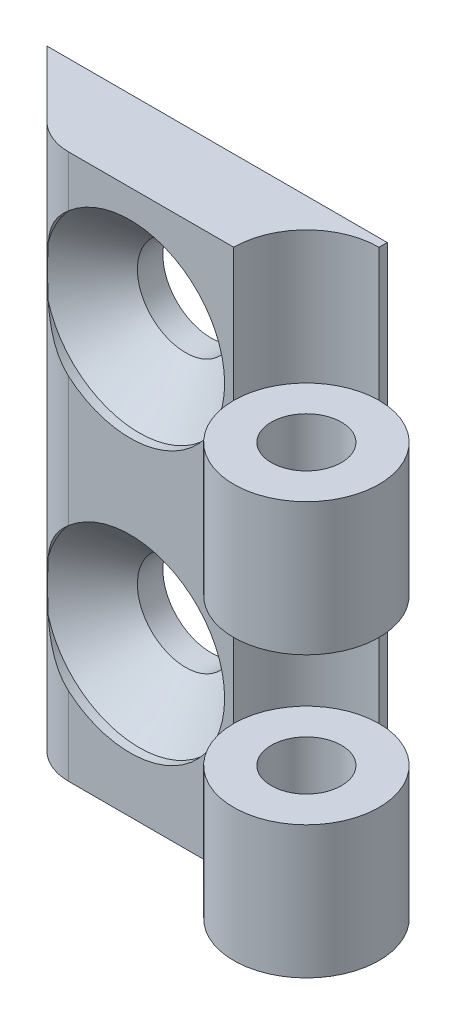
ISO-10303-21;
HEADER;
FILE_DESCRIPTION(('STEP AP214'),'2;1');
FILE_NAME('part.step','',(''),(''),'','','');
FILE_SCHEMA(('AUTOMOTIVE_DESIGN { 1 0 10303 214 1 1 1 1 }'));
ENDSEC;
DATA;
#1=APPLICATION_CONTEXT('core data for automotive mechanical design processes');
#2=APPLICATION_PROTOCOL_DEFINITION('international standard','automotive_design',2000,#1);
#3=PRODUCT_CONTEXT('',#1,'mechanical');
#4=PRODUCT('Part','Part','',(#3));
#5=PRODUCT_RELATED_PRODUCT_CATEGORY('part','',(#4));
#6=PRODUCT_DEFINITION_FORMATION('','',#4);
#7=PRODUCT_DEFINITION_CONTEXT('part definition',#1,'design');
#8=PRODUCT_DEFINITION('design','',#6,#7);
#9=PRODUCT_DEFINITION_SHAPE('','',#8);
#10=(LENGTH_UNIT() NAMED_UNIT(*) SI_UNIT(.MILLI.,.METRE.));
#11=(NAMED_UNIT(*) PLANE_ANGLE_UNIT() SI_UNIT($,.RADIAN.));
#12=(NAMED_UNIT(*) SI_UNIT($,.STERADIAN.) SOLID_ANGLE_UNIT());
#13=UNCERTAINTY_MEASURE_WITH_UNIT(LENGTH_MEASURE(1.E-05),#10,'distance_accuracy_value','');
#14=(GEOMETRIC_REPRESENTATION_CONTEXT(3) GLOBAL_UNCERTAINTY_ASSIGNED_CONTEXT((#13)) GLOBAL_UNIT_ASSIGNED_CONTEXT((#10,
#11,#12)) REPRESENTATION_CONTEXT('',''));
#15=CARTESIAN_POINT('',(0.,0.,0.));
#16=DIRECTION('',(0.,0.,1.));
#17=DIRECTION('',(1.,0.,0.));
#18=AXIS2_PLACEMENT_3D('',#15,#16,#17);
#19=CARTESIAN_POINT('',(0.,7.3,0.));
#20=DIRECTION('',(0.,0.,-1.));
#21=DIRECTION('',(-1.,0.,0.));
#22=AXIS2_PLACEMENT_3D('',#19,#20,#21);
#23=PLANE('',#22);
#24=CARTESIAN_POINT('',(-9.7,23.25,0.));
#25=DIRECTION('',(0.,0.,1.));
#26=DIRECTION('',(1.,0.,0.));
#27=AXIS2_PLACEMENT_3D('',#24,#25,#26);
#28=CIRCLE('',#27,5.2);
#29=CARTESIAN_POINT('',(-13.08199302498,19.3000476991504,0.));
#30=VERTEX_POINT('',#29);
#31=CARTESIAN_POINT('',(-13.08199302498,27.1999523008496,0.));
#32=VERTEX_POINT('',#31);
#33=EDGE_CURVE('E144',#30,#32,#28,.T.);
#34=ORIENTED_EDGE('',*,*,#33,.F.);
#35=DIRECTION('',(0.,-1.,0.));
#36=VECTOR('',#35,1.);
#37=CARTESIAN_POINT('',(-13.08199302498,7.3,0.));
#38=LINE('',#37,#36);
#39=CARTESIAN_POINT('',(-13.08199302498,12.1999523008496,0.));
#40=VERTEX_POINT('',#39);
#41=EDGE_CURVE('E62',#30,#40,#38,.T.);
#42=ORIENTED_EDGE('',*,*,#41,.T.);
#43=CARTESIAN_POINT('',(-9.7,8.25000000000001,0.));
#44=DIRECTION('',(0.,0.,1.));
#45=DIRECTION('',(1.,0.,0.));
#46=AXIS2_PLACEMENT_3D('',#43,#44,#45);
#47=CIRCLE('',#46,5.2);
#48=CARTESIAN_POINT('',(-13.08199302498,4.30004769915042,0.));
#49=VERTEX_POINT('',#48);
#50=EDGE_CURVE('E325',#49,#40,#47,.T.);
#51=ORIENTED_EDGE('',*,*,#50,.F.);
#52=CARTESIAN_POINT('',(-13.08199302498,0.,0.));
#53=VERTEX_POINT('',#52);
#54=EDGE_CURVE('E151',#49,#53,#38,.T.);
#55=ORIENTED_EDGE('',*,*,#54,.T.);
#56=DIRECTION('',(1.,0.,0.));
#57=VECTOR('',#56,1.);
#58=CARTESIAN_POINT('',(0.,0.,0.));
#59=LINE('',#58,#57);
#60=CARTESIAN_POINT('',(-4.,0.,0.));
#61=VERTEX_POINT('',#60);
#62=EDGE_CURVE('E263',#53,#61,#59,.T.);
#63=ORIENTED_EDGE('',*,*,#62,.T.);
#64=DIRECTION('',(0.,-1.,0.));
#65=VECTOR('',#64,1.);
#66=CARTESIAN_POINT('',(-4.,7.3,0.));
#67=LINE('',#66,#65);
#68=CARTESIAN_POINT('',(-4.,7.3,0.));
#69=VERTEX_POINT('',#68);
#70=EDGE_CURVE('E167',#69,#61,#67,.T.);
#71=ORIENTED_EDGE('',*,*,#70,.F.);
#72=DIRECTION('',(0.,-1.,0.));
#73=VECTOR('',#72,1.);
#74=CARTESIAN_POINT('',(-4.,30.,0.));
#75=LINE('',#74,#73);
#76=CARTESIAN_POINT('',(-4.,15.4,0.));
#77=VERTEX_POINT('',#76);
#78=EDGE_CURVE('E285',#77,#69,#75,.T.);
#79=ORIENTED_EDGE('',*,*,#78,.F.);
#80=CARTESIAN_POINT('',(-4.,22.7,0.));
#81=VERTEX_POINT('',#80);
#82=EDGE_CURVE('E284',#81,#77,#75,.T.);
#83=ORIENTED_EDGE('',*,*,#82,.F.);
#84=CARTESIAN_POINT('',(-4.,30.,0.));
#85=VERTEX_POINT('',#84);
#86=EDGE_CURVE('E281',#85,#81,#75,.T.);
#87=ORIENTED_EDGE('',*,*,#86,.F.);
#88=DIRECTION('',(1.,0.,0.));
#89=VECTOR('',#88,1.);
#90=CARTESIAN_POINT('',(0.,30.,0.));
#91=LINE('',#90,#89);
#92=CARTESIAN_POINT('',(-13.08199302498,30.,0.));
#93=VERTEX_POINT('',#92);
#94=EDGE_CURVE('E286',#93,#85,#91,.T.);
#95=ORIENTED_EDGE('',*,*,#94,.F.);
#96=EDGE_CURVE('E150',#93,#32,#38,.T.);
#97=ORIENTED_EDGE('',*,*,#96,.T.);
#98=EDGE_LOOP('',(#34,#42,#51,#55,#63,#71,#79,#83,#87,#95,#97));
#99=FACE_BOUND('',#98,.T.);
#100=ADVANCED_FACE('F35',(#99),#23,.F.);
#101=CARTESIAN_POINT('',(0.,30.,0.));
#102=DIRECTION('',(0.,-1.,0.));
#103=DIRECTION('',(0.,0.,-1.));
#104=AXIS2_PLACEMENT_3D('',#101,#102,#103);
#105=CYLINDRICAL_SURFACE('',#104,4.);
#106=DIRECTION('',(0.,-1.,0.));
#107=VECTOR('',#106,1.);
#108=CARTESIAN_POINT('',(0.,30.,-4.));
#109=LINE('',#108,#107);
#110=CARTESIAN_POINT('',(0.,15.4,-4.));
#111=VERTEX_POINT('',#110);
#112=CARTESIAN_POINT('',(0.,7.3,-4.));
#113=VERTEX_POINT('',#112);
#114=EDGE_CURVE('E280',#111,#113,#109,.T.);
#115=ORIENTED_EDGE('',*,*,#114,.F.);
#116=CARTESIAN_POINT('',(0.,15.4,0.));
#117=DIRECTION('',(0.,1.,0.));
#118=DIRECTION('',(0.,0.,1.));
#119=AXIS2_PLACEMENT_3D('',#116,#117,#118);
#120=CIRCLE('',#119,4.);
#121=EDGE_CURVE('E303',#111,#77,#120,.T.);
#122=ORIENTED_EDGE('',*,*,#121,.T.);
#123=ORIENTED_EDGE('',*,*,#78,.T.);
#124=CARTESIAN_POINT('',(0.,7.3,0.));
#125=DIRECTION('',(0.,1.,0.));
#126=DIRECTION('',(0.,0.,1.));
#127=AXIS2_PLACEMENT_3D('',#124,#125,#126);
#128=CIRCLE('',#127,4.);
#129=EDGE_CURVE('E269',#69,#113,#128,.F.);
#130=ORIENTED_EDGE('',*,*,#129,.T.);
#131=EDGE_LOOP('',(#115,#122,#123,#130));
#132=FACE_BOUND('',#131,.T.);
#133=ADVANCED_FACE('F217',(#132),#105,.F.);
#134=CARTESIAN_POINT('',(0.,7.3,0.));
#135=DIRECTION('',(0.,-1.,0.));
#136=DIRECTION('',(0.,0.,-1.));
#137=AXIS2_PLACEMENT_3D('',#134,#135,#136);
#138=CYLINDRICAL_SURFACE('',#137,4.);
#139=CARTESIAN_POINT('',(0.,0.,0.));
#140=DIRECTION('',(0.,1.,0.));
#141=DIRECTION('',(0.,0.,1.));
#142=AXIS2_PLACEMENT_3D('',#139,#140,#141);
#143=CIRCLE('',#142,4.);
#144=CARTESIAN_POINT('',(0.,0.,-4.));
#145=VERTEX_POINT('',#144);
#146=EDGE_CURVE('E260',#61,#145,#143,.T.);
#147=ORIENTED_EDGE('',*,*,#146,.T.);
#148=DIRECTION('',(0.,-1.,0.));
#149=VECTOR('',#148,1.);
#150=CARTESIAN_POINT('',(0.,7.3,-4.));
#151=LINE('',#150,#149);
#152=EDGE_CURVE('E165',#113,#145,#151,.T.);
#153=ORIENTED_EDGE('',*,*,#152,.F.);
#154=CARTESIAN_POINT('',(0.,7.3,0.));
#155=DIRECTION('',(0.,1.,0.));
#156=DIRECTION('',(0.,0.,1.));
#157=AXIS2_PLACEMENT_3D('',#154,#155,#156);
#158=CIRCLE('',#157,4.);
#159=EDGE_CURVE('E155',#69,#113,#158,.T.);
#160=ORIENTED_EDGE('',*,*,#159,.F.);
#161=ORIENTED_EDGE('',*,*,#70,.T.);
#162=EDGE_LOOP('',(#147,#153,#160,#161));
#163=FACE_BOUND('',#162,.T.);
#164=ADVANCED_FACE('F221',(#163),#138,.T.);
#165=CARTESIAN_POINT('',(0.,7.3,0.));
#166=DIRECTION('',(1.,0.,0.));
#167=DIRECTION('',(0.,0.,-1.));
#168=AXIS2_PLACEMENT_3D('',#165,#166,#167);
#169=PLANE('',#168);
#170=DIRECTION('',(0.,0.,1.));
#171=VECTOR('',#170,1.);
#172=CARTESIAN_POINT('',(0.,0.,0.));
#173=LINE('',#172,#171);
#174=CARTESIAN_POINT('',(0.,0.,-4.45));
#175=VERTEX_POINT('',#174);
#176=EDGE_CURVE('E255',#175,#145,#173,.T.);
#177=ORIENTED_EDGE('',*,*,#176,.F.);
#178=DIRECTION('',(0.,-1.,0.));
#179=VECTOR('',#178,1.);
#180=CARTESIAN_POINT('',(0.,7.3,-4.45));
#181=LINE('',#180,#179);
#182=CARTESIAN_POINT('',(0.,30.,-4.45));
#183=VERTEX_POINT('',#182);
#184=EDGE_CURVE('E163',#183,#175,#181,.T.);
#185=ORIENTED_EDGE('',*,*,#184,.F.);
#186=DIRECTION('',(0.,0.,1.));
#187=VECTOR('',#186,1.);
#188=CARTESIAN_POINT('',(0.,30.,0.));
#189=LINE('',#188,#187);
#190=CARTESIAN_POINT('',(0.,30.,-4.));
#191=VERTEX_POINT('',#190);
#192=EDGE_CURVE('E296',#183,#191,#189,.T.);
#193=ORIENTED_EDGE('',*,*,#192,.T.);
#194=CARTESIAN_POINT('',(0.,22.7,-4.));
#195=VERTEX_POINT('',#194);
#196=EDGE_CURVE('E276',#191,#195,#109,.T.);
#197=ORIENTED_EDGE('',*,*,#196,.T.);
#198=EDGE_CURVE('E279',#195,#111,#109,.T.);
#199=ORIENTED_EDGE('',*,*,#198,.T.);
#200=ORIENTED_EDGE('',*,*,#114,.T.);
#201=ORIENTED_EDGE('',*,*,#152,.T.);
#202=EDGE_LOOP('',(#177,#185,#193,#197,#199,#200,#201));
#203=FACE_BOUND('',#202,.T.);
#204=ADVANCED_FACE('F228',(#203),#169,.T.);
#205=CARTESIAN_POINT('',(0.,7.3,-4.45));
#206=DIRECTION('',(0.,0.,1.));
#207=DIRECTION('',(1.,0.,0.));
#208=AXIS2_PLACEMENT_3D('',#205,#206,#207);
#209=PLANE('',#208);
#210=CARTESIAN_POINT('',(-9.7,23.25,-4.45));
#211=DIRECTION('',(0.,0.,1.));
#212=DIRECTION('',(1.,0.,0.));
#213=AXIS2_PLACEMENT_3D('',#210,#211,#212);
#214=CIRCLE('',#213,2.65);
#215=CARTESIAN_POINT('',(-7.05,23.25,-4.45));
#216=VERTEX_POINT('',#215);
#217=EDGE_CURVE('E327',#216,#216,#214,.T.);
#218=ORIENTED_EDGE('',*,*,#217,.T.);
#219=EDGE_LOOP('',(#218));
#220=FACE_BOUND('',#219,.T.);
#221=CARTESIAN_POINT('',(-9.7,8.25000000000001,-4.45));
#222=DIRECTION('',(0.,0.,1.));
#223=DIRECTION('',(1.,0.,0.));
#224=AXIS2_PLACEMENT_3D('',#221,#222,#223);
#225=CIRCLE('',#224,2.65);
#226=CARTESIAN_POINT('',(-7.05,8.25000000000001,-4.45));
#227=VERTEX_POINT('',#226);
#228=EDGE_CURVE('E311',#227,#227,#225,.T.);
#229=ORIENTED_EDGE('',*,*,#228,.T.);
#230=EDGE_LOOP('',(#229));
#231=FACE_BOUND('',#230,.T.);
#232=DIRECTION('',(-1.,0.,0.));
#233=VECTOR('',#232,1.);
#234=CARTESIAN_POINT('',(0.,0.,-4.45));
#235=LINE('',#234,#233);
#236=CARTESIAN_POINT('',(-18.73,0.,-4.45));
#237=VERTEX_POINT('',#236);
#238=EDGE_CURVE('E252',#175,#237,#235,.T.);
#239=ORIENTED_EDGE('',*,*,#238,.T.);
#240=DIRECTION('',(0.,-1.,0.));
#241=VECTOR('',#240,1.);
#242=CARTESIAN_POINT('',(-18.73,7.3,-4.45));
#243=LINE('',#242,#241);
#244=CARTESIAN_POINT('',(-18.73,30.,-4.45));
#245=VERTEX_POINT('',#244);
#246=EDGE_CURVE('E161',#245,#237,#243,.T.);
#247=ORIENTED_EDGE('',*,*,#246,.F.);
#248=DIRECTION('',(-1.,0.,0.));
#249=VECTOR('',#248,1.);
#250=CARTESIAN_POINT('',(0.,30.,-4.45));
#251=LINE('',#250,#249);
#252=EDGE_CURVE('E293',#183,#245,#251,.T.);
#253=ORIENTED_EDGE('',*,*,#252,.F.);
#254=ORIENTED_EDGE('',*,*,#184,.T.);
#255=EDGE_LOOP('',(#239,#247,#253,#254));
#256=FACE_BOUND('',#255,.T.);
#257=ADVANCED_FACE('F232',(#220,#231,#256),#209,.F.);
#258=CARTESIAN_POINT('',(-7.13999999999992,7.3,7.13999999999998));
#259=DIRECTION('',(-0.707106781186545,0.,0.70710678118655));
#260=DIRECTION('',(0.70710678118655,0.,0.707106781186545));
#261=AXIS2_PLACEMENT_3D('',#258,#259,#260);
#262=PLANE('',#261);
#263=DIRECTION('',(-0.70710678118655,0.,-0.707106781186545));
#264=VECTOR('',#263,1.);
#265=CARTESIAN_POINT('',(-7.13999999999992,0.,7.13999999999998));
#266=LINE('',#265,#264);
#267=CARTESIAN_POINT('',(-15.1271188559454,0.,-0.847118855945423));
#268=VERTEX_POINT('',#267);
#269=EDGE_CURVE('E245',#268,#237,#266,.T.);
#270=ORIENTED_EDGE('',*,*,#269,.F.);
#271=DIRECTION('',(0.,-1.,0.));
#272=VECTOR('',#271,1.);
#273=CARTESIAN_POINT('',(-15.1271188559454,7.3,-0.847118855945423));
#274=LINE('',#273,#272);
#275=CARTESIAN_POINT('',(-15.1271188559454,30.,-0.847118855945423));
#276=VERTEX_POINT('',#275);
#277=EDGE_CURVE('E154',#276,#268,#274,.T.);
#278=ORIENTED_EDGE('',*,*,#277,.F.);
#279=DIRECTION('',(-0.70710678118655,0.,-0.707106781186545));
#280=VECTOR('',#279,1.);
#281=CARTESIAN_POINT('',(-7.13999999999992,30.,7.13999999999998));
#282=LINE('',#281,#280);
#283=EDGE_CURVE('E291',#276,#245,#282,.T.);
#284=ORIENTED_EDGE('',*,*,#283,.T.);
#285=ORIENTED_EDGE('',*,*,#246,.T.);
#286=EDGE_LOOP('',(#270,#278,#284,#285));
#287=FACE_BOUND('',#286,.T.);
#288=ADVANCED_FACE('F235',(#287),#262,.T.);
#289=CARTESIAN_POINT('',(0.,7.3,0.));
#290=DIRECTION('',(0.,-1.,0.));
#291=DIRECTION('',(0.,0.,-1.));
#292=AXIS2_PLACEMENT_3D('',#289,#290,#291);
#293=CYLINDRICAL_SURFACE('',#292,1.93);
#294=CARTESIAN_POINT('',(0.,7.3,0.));
#295=DIRECTION('',(0.,1.,0.));
#296=DIRECTION('',(0.,0.,1.));
#297=AXIS2_PLACEMENT_3D('',#294,#295,#296);
#298=CIRCLE('',#297,1.93);
#299=CARTESIAN_POINT('',(0.,7.3,1.93));
#300=VERTEX_POINT('',#299);
#301=EDGE_CURVE('E254',#300,#300,#298,.T.);
#302=ORIENTED_EDGE('',*,*,#301,.T.);
#303=EDGE_LOOP('',(#302));
#304=FACE_BOUND('',#303,.T.);
#305=CARTESIAN_POINT('',(0.,0.,0.));
#306=DIRECTION('',(0.,1.,0.));
#307=DIRECTION('',(0.,0.,1.));
#308=AXIS2_PLACEMENT_3D('',#305,#306,#307);
#309=CIRCLE('',#308,1.93);
#310=CARTESIAN_POINT('',(0.,0.,1.93));
#311=VERTEX_POINT('',#310);
#312=EDGE_CURVE('E266',#311,#311,#309,.T.);
#313=ORIENTED_EDGE('',*,*,#312,.F.);
#314=EDGE_LOOP('',(#313));
#315=FACE_BOUND('',#314,.T.);
#316=ADVANCED_FACE('F37',(#304,#315),#293,.F.);
#317=CARTESIAN_POINT('',(-13.08199302498,7.3,-2.89224468691088));
#318=DIRECTION('',(0.,-1.,0.));
#319=DIRECTION('',(0.,0.,-1.));
#320=AXIS2_PLACEMENT_3D('',#317,#318,#319);
#321=CYLINDRICAL_SURFACE('',#320,2.89224468691088);
#322=ORIENTED_EDGE('',*,*,#41,.F.);
#323=CARTESIAN_POINT('',(-13.08199302498,19.3000476991504,0.));
#324=CARTESIAN_POINT('',(-13.1767147870625,19.3811196217578,-1.00539414458187E-05));
#325=CARTESIAN_POINT('',(-13.268398484987,19.465551377186,-0.00464985299401729));
#326=CARTESIAN_POINT('',(-13.4449809693199,19.6402291733133,-0.0214991172946126));
#327=CARTESIAN_POINT('',(-13.5298924121537,19.7304637704602,-0.0336940701537907));
#328=CARTESIAN_POINT('',(-13.6908214915126,19.9141412696155,-0.0636477969334252));
#329=CARTESIAN_POINT('',(-13.7669922505989,20.0074719090353,-0.0812799636579385));
#330=CARTESIAN_POINT('',(-13.9123296828359,20.1986558073096,-0.120730168707441));
#331=CARTESIAN_POINT('',(-13.9814925717242,20.2965114685853,-0.142550450409404));
#332=CARTESIAN_POINT('',(-14.1195977893603,20.5068940778026,-0.191434477895897));
#333=CARTESIAN_POINT('',(-14.1877367881172,20.6198755158014,-0.218808974987252));
#334=CARTESIAN_POINT('',(-14.3150916500762,20.8503616244936,-0.27511014530398));
#335=CARTESIAN_POINT('',(-14.3743081680136,20.9678659624996,-0.304036704426977));
#336=CARTESIAN_POINT('',(-14.485065223342,21.2100667000331,-0.362327347882241));
#337=CARTESIAN_POINT('',(-14.5363777887872,21.3348693438041,-0.391684380014222));
#338=CARTESIAN_POINT('',(-14.6292847646989,21.5885631840521,-0.448085033824121));
#339=CARTESIAN_POINT('',(-14.6708777181129,21.7174549902442,-0.475128308265413));
#340=CARTESIAN_POINT('',(-14.7074913137859,21.8482044577189,-0.499999999999978));
#341=B_SPLINE_CURVE_WITH_KNOTS('',3,(#323,#324,#325,#326,#327,#328,#329,#330,#331,#332,#333,
#334,#335,#336,#337,#338,#339,#340),.UNSPECIFIED.,.F.,.F.,(4,2,2,2,2,2,2,2,4),(0.,
0.373694567496064,0.746673536348772,1.1115509165511,1.47662429269208,1.88046496030271,
2.28427597947749,2.69814665093545,3.11207932538282),.UNSPECIFIED.);
#342=CARTESIAN_POINT('',(-14.7074913137858,21.8482044577189,-0.5));
#343=VERTEX_POINT('',#342);
#344=EDGE_CURVE('E11',#30,#343,#341,.T.);
#345=ORIENTED_EDGE('',*,*,#344,.T.);
#346=CARTESIAN_POINT('',(-13.2941594271494,18.8360171179622,-0.00779244311227001));
#347=CARTESIAN_POINT('',(-13.3520966949426,18.8887099343555,-0.0120725753953744));
#348=CARTESIAN_POINT('',(-13.4077755082868,18.9436483211992,-0.0179043052457737));
#349=CARTESIAN_POINT('',(-13.5147218914548,19.0571905984944,-0.0320425607911641));
#350=CARTESIAN_POINT('',(-13.5659972862931,19.115787653217,-0.0403445743192055));
#351=CARTESIAN_POINT('',(-13.6641568208074,19.2356584946741,-0.0587597503717428));
#352=CARTESIAN_POINT('',(-13.7110654005403,19.2969141665977,-0.0688617782722779));
#353=CARTESIAN_POINT('',(-13.801101981577,19.421953862554,-0.090440984404511));
#354=CARTESIAN_POINT('',(-13.8442275855114,19.4857394532127,-0.101919023902368));
#355=CARTESIAN_POINT('',(-13.9678295580581,19.6795542981001,-0.137661138987836));
#356=CARTESIAN_POINT('',(-14.0430508846622,19.8126924015084,-0.163341026777154));
#357=CARTESIAN_POINT('',(-14.1810970671218,20.0850203609692,-0.215961000626984));
#358=CARTESIAN_POINT('',(-14.2439120279635,20.2242149404151,-0.242902071562464));
#359=CARTESIAN_POINT('',(-14.3586404992244,20.5076527590812,-0.296235944344342));
#360=CARTESIAN_POINT('',(-14.4105170537144,20.6519112513653,-0.322626624436383));
#361=CARTESIAN_POINT('',(-14.5041177181581,20.9439528697186,-0.373223547310169));
#362=CARTESIAN_POINT('',(-14.5458479516686,21.0917338104665,-0.397431102084223));
#363=CARTESIAN_POINT('',(-14.5960641139273,21.293902984245,-0.427918724459601));
#364=CARTESIAN_POINT('',(-14.608638509294,21.347080649487,-0.435695408749028));
#365=CARTESIAN_POINT('',(-14.6326235731095,21.4537195428214,-0.450764816787085));
#366=CARTESIAN_POINT('',(-14.6440351681354,21.5071805088546,-0.458057924229188));
#367=CARTESIAN_POINT('',(-14.694687403194,21.7574704490492,-0.490877141494838));
#368=CARTESIAN_POINT('',(-14.7269348767974,21.9562119192507,-0.513128192628503));
#369=CARTESIAN_POINT('',(-14.7771985423036,22.3563852225991,-0.548678377408821));
#370=CARTESIAN_POINT('',(-14.7952044569942,22.5578188921321,-0.561971045348172));
#371=CARTESIAN_POINT('',(-14.8174299460239,22.962102803357,-0.578474631673082));
#372=CARTESIAN_POINT('',(-14.8216334891112,23.1649544182438,-0.581673826469321));
#373=CARTESIAN_POINT('',(-14.8163141274307,23.5702647276562,-0.577676807998191));
#374=CARTESIAN_POINT('',(-14.8067991175236,23.7727235810843,-0.570486573715838));
#375=CARTESIAN_POINT('',(-14.777013486777,24.1368062643218,-0.548691764820559));
#376=CARTESIAN_POINT('',(-14.7591848942308,24.298739304556,-0.535794300117286));
#377=CARTESIAN_POINT('',(-14.7141688307676,24.6206129933777,-0.504392922256884));
#378=CARTESIAN_POINT('',(-14.6869893496758,24.7805552225052,-0.4858937970259));
#379=CARTESIAN_POINT('',(-14.6184416439859,25.1193006020545,-0.441469976839356));
#380=CARTESIAN_POINT('',(-14.5756520717037,25.2977307133821,-0.414879546251043));
#381=CARTESIAN_POINT('',(-14.4763185706352,25.650060594471,-0.357637929713079));
#382=CARTESIAN_POINT('',(-14.4197780699286,25.8239614814154,-0.326987756715239));
#383=CARTESIAN_POINT('',(-14.3200600299157,26.0893824648731,-0.278086430211907));
#384=CARTESIAN_POINT('',(-14.2821861412475,26.1830199030022,-0.260408864625678));
#385=CARTESIAN_POINT('',(-14.2013994183068,26.3680780822817,-0.225045178577659));
#386=CARTESIAN_POINT('',(-14.1584878752386,26.4594993842349,-0.207359061460092));
#387=CARTESIAN_POINT('',(-14.0670908236163,26.6399642732693,-0.172488496561377));
#388=CARTESIAN_POINT('',(-14.0185901079335,26.7290005204187,-0.155305584959505));
#389=CARTESIAN_POINT('',(-13.9155684331301,26.9038734438222,-0.122205799084626));
#390=CARTESIAN_POINT('',(-13.8610416002437,26.9897068873072,-0.10629018652937));
#391=CARTESIAN_POINT('',(-13.8032771298023,27.0735724413653,-0.0913825751504312));
#392=B_SPLINE_CURVE_WITH_KNOTS('',3,(#346,#347,#348,#349,#350,#351,#352,#353,#354,#355,#356,
#357,#358,#359,#360,#361,#362,#363,#364,#365,#366,#367,#368,#369,#370,#371,#372,#373,#374,#375,
#376,#377,#378,#379,#380,#381,#382,#383,#384,#385,#386,#387,#388,#389,#390,#391),.UNSPECIFIED.,
.F.,.F.,(4,2,2,2,2,2,2,2,2,2,2,2,2,2,2,2,2,2,2,2,2,2,4),(0.,0.235107555786181,0.46978827818702,
0.703064741439685,0.936487985819625,1.40082954798317,1.86553997520225,2.33179614543739,
2.7977702160933,2.96334299326038,3.12878278471138,3.7356698185491,4.34299440495368,
4.95102414088309,5.55870410272295,6.048606349382,6.53809103658333,7.09374291733782,
7.64925641689335,7.95676049990135,8.26418593772705,8.57246850428765,8.88105425477153),.UNSPECIFIED.);
#393=CARTESIAN_POINT('',(-14.7074913137858,24.6517955422811,-0.5));
#394=VERTEX_POINT('',#393);
#395=EDGE_CURVE('E135',#343,#394,#392,.T.);
#396=ORIENTED_EDGE('',*,*,#395,.T.);
#397=CARTESIAN_POINT('',(-14.7074913137858,24.6517955422811,-0.5));
#398=CARTESIAN_POINT('',(-14.6669026748948,24.7967218570265,-0.472429156104237));
#399=CARTESIAN_POINT('',(-14.6202046212333,24.9393623283245,-0.442194445609938));
#400=CARTESIAN_POINT('',(-14.5148716588684,25.2196388814641,-0.379136643031952));
#401=CARTESIAN_POINT('',(-14.4562328803519,25.3572733238386,-0.34631271393876));
#402=CARTESIAN_POINT('',(-14.3290934706668,25.6233144193386,-0.281734452208336));
#403=CARTESIAN_POINT('',(-14.2609071351798,25.751870590835,-0.249975458715485));
#404=CARTESIAN_POINT('',(-14.1136975927868,26.0032668938005,-0.189096963505816));
#405=CARTESIAN_POINT('',(-14.0346775763353,26.1261086939064,-0.159976688879999));
#406=CARTESIAN_POINT('',(-13.8894404559948,26.3321684994034,-0.114262584107921));
#407=CARTESIAN_POINT('',(-13.8257667171946,26.4169122734584,-0.0964364152329789));
#408=CARTESIAN_POINT('',(-13.6930144253342,26.5827333139074,-0.0644555710812442));
#409=CARTESIAN_POINT('',(-13.6239385340334,26.6638123553058,-0.0502991023142385));
#410=CARTESIAN_POINT('',(-13.479116924382,26.8235290915679,-0.026435192278141));
#411=CARTESIAN_POINT('',(-13.4032657001788,26.9020859058712,-0.016822060404739));
#412=CARTESIAN_POINT('',(-13.2463908943507,27.0546211030749,-0.00360265020468247));
#413=CARTESIAN_POINT('',(-13.165359716423,27.1285924333659,-5.41408016381377E-06));
#414=CARTESIAN_POINT('',(-13.08199302498,27.1999523008496,0.));
#415=B_SPLINE_CURVE_WITH_KNOTS('',3,(#397,#398,#399,#400,#401,#402,#403,#404,#405,#406,#407,
#408,#409,#410,#411,#412,#413,#414),.UNSPECIFIED.,.F.,.F.,(4,2,2,2,2,2,2,2,4),(0.,
0.458777067704738,0.917703055611095,1.36405246138986,1.81027070115233,2.1325034753145,
2.45457846667113,2.78307352137612,3.11206187882259),.UNSPECIFIED.);
#416=EDGE_CURVE('E48',#394,#32,#415,.T.);
#417=ORIENTED_EDGE('',*,*,#416,.T.);
#418=ORIENTED_EDGE('',*,*,#96,.F.);
#419=CARTESIAN_POINT('',(-13.08199302498,30.,-2.89224468691088));
#420=DIRECTION('',(0.,1.,0.));
#421=DIRECTION('',(0.,0.,1.));
#422=AXIS2_PLACEMENT_3D('',#419,#420,#421);
#423=CIRCLE('',#422,2.89224468691088);
#424=EDGE_CURVE('E288',#276,#93,#423,.T.);
#425=ORIENTED_EDGE('',*,*,#424,.F.);
#426=ORIENTED_EDGE('',*,*,#277,.T.);
#427=CARTESIAN_POINT('',(-13.08199302498,0.,-2.89224468691088));
#428=DIRECTION('',(0.,1.,0.));
#429=DIRECTION('',(0.,0.,1.));
#430=AXIS2_PLACEMENT_3D('',#427,#428,#429);
#431=CIRCLE('',#430,2.89224468691088);
#432=EDGE_CURVE('E158',#268,#53,#431,.T.);
#433=ORIENTED_EDGE('',*,*,#432,.T.);
#434=ORIENTED_EDGE('',*,*,#54,.F.);
#435=CARTESIAN_POINT('',(-13.08199302498,4.30004769915042,0.));
#436=CARTESIAN_POINT('',(-13.1767147870625,4.38111962175775,-1.00539414465793E-05));
#437=CARTESIAN_POINT('',(-13.268398484987,4.465551377186,-0.00464985299401807));
#438=CARTESIAN_POINT('',(-13.4449809693199,4.64022917331327,-0.0214991172946129));
#439=CARTESIAN_POINT('',(-13.5298924121537,4.73046377046022,-0.0336940701537905));
#440=CARTESIAN_POINT('',(-13.6908214915126,4.91414126961545,-0.0636477969334246));
#441=CARTESIAN_POINT('',(-13.7669922505989,5.00747190903531,-0.0812799636579382));
#442=CARTESIAN_POINT('',(-13.9123296828359,5.19865580730962,-0.120730168707441));
#443=CARTESIAN_POINT('',(-13.9814925717242,5.29651146858529,-0.142550450409404));
#444=CARTESIAN_POINT('',(-14.1195977893603,5.50689407780264,-0.191434477895898));
#445=CARTESIAN_POINT('',(-14.1877367881172,5.6198755158014,-0.218808974987252));
#446=CARTESIAN_POINT('',(-14.3150916500762,5.85036162449358,-0.275110145303981));
#447=CARTESIAN_POINT('',(-14.3743081680136,5.96786596249961,-0.304036704426978));
#448=CARTESIAN_POINT('',(-14.485065223342,6.2100667000331,-0.362327347882242));
#449=CARTESIAN_POINT('',(-14.5363777887872,6.33486934380415,-0.391684380014222));
#450=CARTESIAN_POINT('',(-14.6292847646989,6.58856318405211,-0.448085033824121));
#451=CARTESIAN_POINT('',(-14.6708777181129,6.71745499024417,-0.475128308265413));
#452=CARTESIAN_POINT('',(-14.7074913137859,6.84820445771887,-0.499999999999978));
#453=B_SPLINE_CURVE_WITH_KNOTS('',3,(#435,#436,#437,#438,#439,#440,#441,#442,#443,#444,#445,
#446,#447,#448,#449,#450,#451,#452),.UNSPECIFIED.,.F.,.F.,(4,2,2,2,2,2,2,2,4),(0.,
0.373694567496064,0.74667353634877,1.1115509165511,1.47662429269208,1.88046496030271,
2.2842759794775,2.69814665093546,3.11207932538282),.UNSPECIFIED.);
#454=CARTESIAN_POINT('',(-14.7074913137858,6.84820445771887,-0.5));
#455=VERTEX_POINT('',#454);
#456=EDGE_CURVE('E139',#49,#455,#453,.T.);
#457=ORIENTED_EDGE('',*,*,#456,.T.);
#458=CARTESIAN_POINT('',(-13.2941594271494,3.83601711796216,-0.00779244311227025));
#459=CARTESIAN_POINT('',(-13.3520966949426,3.88870993435548,-0.0120725753953744));
#460=CARTESIAN_POINT('',(-13.4077755082868,3.94364832119918,-0.0179043052457738));
#461=CARTESIAN_POINT('',(-13.5147218914548,4.05719059849437,-0.0320425607911644));
#462=CARTESIAN_POINT('',(-13.5659972862931,4.11578765321697,-0.0403445743192061));
#463=CARTESIAN_POINT('',(-13.6641568208074,4.23565849467408,-0.0587597503717433));
#464=CARTESIAN_POINT('',(-13.7110654005403,4.29691416659773,-0.0688617782722781));
#465=CARTESIAN_POINT('',(-13.801101981577,4.42195386255399,-0.0904409844045108));
#466=CARTESIAN_POINT('',(-13.8442275855114,4.48573945321267,-0.101919023902367));
#467=CARTESIAN_POINT('',(-13.9678295580581,4.67955429810006,-0.137661138987836));
#468=CARTESIAN_POINT('',(-14.0430508846622,4.81269240150843,-0.163341026777154));
#469=CARTESIAN_POINT('',(-14.1810970671218,5.0850203609692,-0.215961000626983));
#470=CARTESIAN_POINT('',(-14.2439120279634,5.22421494041512,-0.242902071562462));
#471=CARTESIAN_POINT('',(-14.3586404992244,5.50765275908123,-0.29623594434434));
#472=CARTESIAN_POINT('',(-14.4105170537144,5.65191125136526,-0.322626624436382));
#473=CARTESIAN_POINT('',(-14.5041177181581,5.94395286971861,-0.373223547310168));
#474=CARTESIAN_POINT('',(-14.5458479516686,6.09173381046647,-0.397431102084221));
#475=CARTESIAN_POINT('',(-14.5960641139273,6.29390298424502,-0.4279187244596));
#476=CARTESIAN_POINT('',(-14.608638509294,6.34708064948704,-0.435695408749027));
#477=CARTESIAN_POINT('',(-14.6326235731095,6.45371954282135,-0.450764816787085));
#478=CARTESIAN_POINT('',(-14.6440351681354,6.50718050885465,-0.458057924229188));
#479=CARTESIAN_POINT('',(-14.694687403194,6.75747044904916,-0.490877141494838));
#480=CARTESIAN_POINT('',(-14.7269348767974,6.95621191925075,-0.513128192628503));
#481=CARTESIAN_POINT('',(-14.7771985423036,7.35638522259908,-0.54867837740882));
#482=CARTESIAN_POINT('',(-14.7952044569942,7.55781889213212,-0.561971045348172));
#483=CARTESIAN_POINT('',(-14.8174299460239,7.96210280335701,-0.578474631673082));
#484=CARTESIAN_POINT('',(-14.8216334891112,8.16495441824384,-0.581673826469321));
#485=CARTESIAN_POINT('',(-14.8163141274307,8.57026472765617,-0.577676807998191));
#486=CARTESIAN_POINT('',(-14.8067991175236,8.77272358108427,-0.570486573715838));
#487=CARTESIAN_POINT('',(-14.777013486777,9.13680626432181,-0.54869176482056));
#488=CARTESIAN_POINT('',(-14.7591848942308,9.29873930455602,-0.535794300117286));
#489=CARTESIAN_POINT('',(-14.7141688307676,9.62061299337772,-0.504392922256884));
#490=CARTESIAN_POINT('',(-14.6869893496758,9.78055522250524,-0.4858937970259));
#491=CARTESIAN_POINT('',(-14.6184416439859,10.1193006020545,-0.441469976839357));
#492=CARTESIAN_POINT('',(-14.5756520717037,10.2977307133821,-0.414879546251043));
#493=CARTESIAN_POINT('',(-14.4763185706352,10.650060594471,-0.357637929713081));
#494=CARTESIAN_POINT('',(-14.4197780699286,10.8239614814154,-0.326987756715241));
#495=CARTESIAN_POINT('',(-14.3200600299157,11.0893824648731,-0.278086430211909));
#496=CARTESIAN_POINT('',(-14.2821861412475,11.1830199030022,-0.26040886462568));
#497=CARTESIAN_POINT('',(-14.2013994183068,11.3680780822817,-0.22504517857766));
#498=CARTESIAN_POINT('',(-14.1584878752386,11.4594993842349,-0.207359061460093));
#499=CARTESIAN_POINT('',(-14.0670908236163,11.6399642732693,-0.172488496561378));
#500=CARTESIAN_POINT('',(-14.0185901079335,11.7290005204187,-0.155305584959506));
#501=CARTESIAN_POINT('',(-13.9155684331301,11.9038734438222,-0.122205799084628));
#502=CARTESIAN_POINT('',(-13.8610416002437,11.9897068873072,-0.106290186529371));
#503=CARTESIAN_POINT('',(-13.8032771298023,12.0735724413653,-0.0913825751504324));
#504=B_SPLINE_CURVE_WITH_KNOTS('',3,(#458,#459,#460,#461,#462,#463,#464,#465,#466,#467,#468,
#469,#470,#471,#472,#473,#474,#475,#476,#477,#478,#479,#480,#481,#482,#483,#484,#485,#486,#487,
#488,#489,#490,#491,#492,#493,#494,#495,#496,#497,#498,#499,#500,#501,#502,#503),.UNSPECIFIED.,
.F.,.F.,(4,2,2,2,2,2,2,2,2,2,2,2,2,2,2,2,2,2,2,2,2,2,4),(0.,0.235107555786182,0.469788278187021,
0.703064741439683,0.93648798581962,1.40082954798316,1.86553997520224,2.33179614543738,
2.7977702160933,2.96334299326038,3.12878278471138,3.7356698185491,4.34299440495368,
4.95102414088309,5.55870410272294,6.048606349382,6.53809103658333,7.09374291733781,
7.64925641689333,7.95676049990134,8.26418593772704,8.57246850428764,8.88105425477152),.UNSPECIFIED.);
#505=CARTESIAN_POINT('',(-14.7074913137858,9.65179554228115,-0.5));
#506=VERTEX_POINT('',#505);
#507=EDGE_CURVE('E175',#455,#506,#504,.T.);
#508=ORIENTED_EDGE('',*,*,#507,.T.);
#509=CARTESIAN_POINT('',(-14.7074913137858,9.65179554228115,-0.5));
#510=CARTESIAN_POINT('',(-14.6669026748948,9.79672185702649,-0.472429156104237));
#511=CARTESIAN_POINT('',(-14.6202046212333,9.93936232832454,-0.442194445609938));
#512=CARTESIAN_POINT('',(-14.5148716588684,10.2196388814641,-0.37913664303195));
#513=CARTESIAN_POINT('',(-14.4562328803519,10.3572733238386,-0.346312713938758));
#514=CARTESIAN_POINT('',(-14.3290934706668,10.6233144193386,-0.281734452208334));
#515=CARTESIAN_POINT('',(-14.2609071351798,10.751870590835,-0.249975458715484));
#516=CARTESIAN_POINT('',(-14.1136975927868,11.0032668938006,-0.189096963505815));
#517=CARTESIAN_POINT('',(-14.0346775763353,11.1261086939064,-0.159976688879999));
#518=CARTESIAN_POINT('',(-13.8894404559948,11.3321684994034,-0.11426258410792));
#519=CARTESIAN_POINT('',(-13.8257667171946,11.4169122734584,-0.0964364152329783));
#520=CARTESIAN_POINT('',(-13.6930144253342,11.5827333139074,-0.0644555710812438));
#521=CARTESIAN_POINT('',(-13.6239385340334,11.6638123553058,-0.0502991023142384));
#522=CARTESIAN_POINT('',(-13.479116924382,11.8235290915679,-0.0264351922781411));
#523=CARTESIAN_POINT('',(-13.4032657001788,11.9020859058712,-0.016822060404739));
#524=CARTESIAN_POINT('',(-13.2463908943507,12.0546211030749,-0.00360265020468223));
#525=CARTESIAN_POINT('',(-13.165359716423,12.1285924333659,-5.41408016349671E-06));
#526=CARTESIAN_POINT('',(-13.08199302498,12.1999523008496,0.));
#527=B_SPLINE_CURVE_WITH_KNOTS('',3,(#509,#510,#511,#512,#513,#514,#515,#516,#517,#518,#519,
#520,#521,#522,#523,#524,#525,#526),.UNSPECIFIED.,.F.,.F.,(4,2,2,2,2,2,2,2,4),(0.,
0.458777067704742,0.917703055611102,1.36405246138987,1.81027070115234,2.1325034753145,
2.45457846667113,2.78307352137612,3.11206187882259),.UNSPECIFIED.);
#528=EDGE_CURVE('E149',#506,#40,#527,.T.);
#529=ORIENTED_EDGE('',*,*,#528,.T.);
#530=EDGE_LOOP('',(#322,#345,#396,#417,#418,#425,#426,#433,#434,#457,#508,#529));
#531=FACE_BOUND('',#530,.T.);
#532=ADVANCED_FACE('F146',(#531),#321,.T.);
#533=CARTESIAN_POINT('',(0.,7.3,0.));
#534=DIRECTION('',(0.,1.,0.));
#535=DIRECTION('',(0.,0.,1.));
#536=AXIS2_PLACEMENT_3D('',#533,#534,#535);
#537=PLANE('',#536);
#538=ORIENTED_EDGE('',*,*,#129,.F.);
#539=ORIENTED_EDGE('',*,*,#159,.T.);
#540=EDGE_LOOP('',(#538,#539));
#541=FACE_BOUND('',#540,.T.);
#542=ORIENTED_EDGE('',*,*,#301,.F.);
#543=EDGE_LOOP('',(#542));
#544=FACE_BOUND('',#543,.T.);
#545=ADVANCED_FACE('F378',(#541,#544),#537,.T.);
#546=CARTESIAN_POINT('',(0.,0.,0.));
#547=DIRECTION('',(0.,1.,0.));
#548=DIRECTION('',(0.,0.,1.));
#549=AXIS2_PLACEMENT_3D('',#546,#547,#548);
#550=PLANE('',#549);
#551=ORIENTED_EDGE('',*,*,#312,.T.);
#552=EDGE_LOOP('',(#551));
#553=FACE_BOUND('',#552,.T.);
#554=ORIENTED_EDGE('',*,*,#146,.F.);
#555=ORIENTED_EDGE('',*,*,#62,.F.);
#556=ORIENTED_EDGE('',*,*,#432,.F.);
#557=ORIENTED_EDGE('',*,*,#269,.T.);
#558=ORIENTED_EDGE('',*,*,#238,.F.);
#559=ORIENTED_EDGE('',*,*,#176,.T.);
#560=EDGE_LOOP('',(#554,#555,#556,#557,#558,#559));
#561=FACE_BOUND('',#560,.T.);
#562=ADVANCED_FACE('F342',(#553,#561),#550,.F.);
#563=CARTESIAN_POINT('',(0.,22.7,0.));
#564=DIRECTION('',(0.,1.,0.));
#565=DIRECTION('',(0.,0.,1.));
#566=AXIS2_PLACEMENT_3D('',#563,#564,#565);
#567=CIRCLE('',#566,4.);
#568=EDGE_CURVE('E302',#195,#81,#567,.T.);
#569=ORIENTED_EDGE('',*,*,#568,.F.);
#570=ORIENTED_EDGE('',*,*,#196,.F.);
#571=CARTESIAN_POINT('',(0.,30.,0.));
#572=DIRECTION('',(0.,1.,0.));
#573=DIRECTION('',(0.,0.,1.));
#574=AXIS2_PLACEMENT_3D('',#571,#572,#573);
#575=CIRCLE('',#574,4.);
#576=EDGE_CURVE('E299',#191,#85,#575,.T.);
#577=ORIENTED_EDGE('',*,*,#576,.T.);
#578=ORIENTED_EDGE('',*,*,#86,.T.);
#579=EDGE_LOOP('',(#569,#570,#577,#578));
#580=FACE_BOUND('',#579,.T.);
#581=ADVANCED_FACE('F224',(#580),#105,.F.);
#582=CARTESIAN_POINT('',(0.,30.,0.));
#583=DIRECTION('',(0.,1.,0.));
#584=DIRECTION('',(0.,0.,1.));
#585=AXIS2_PLACEMENT_3D('',#582,#583,#584);
#586=PLANE('',#585);
#587=ORIENTED_EDGE('',*,*,#576,.F.);
#588=ORIENTED_EDGE('',*,*,#192,.F.);
#589=ORIENTED_EDGE('',*,*,#252,.T.);
#590=ORIENTED_EDGE('',*,*,#283,.F.);
#591=ORIENTED_EDGE('',*,*,#424,.T.);
#592=ORIENTED_EDGE('',*,*,#94,.T.);
#593=EDGE_LOOP('',(#587,#588,#589,#590,#591,#592));
#594=FACE_BOUND('',#593,.T.);
#595=ADVANCED_FACE('F337',(#594),#586,.T.);
#596=CARTESIAN_POINT('',(0.,22.7,0.));
#597=DIRECTION('',(0.,-1.,0.));
#598=DIRECTION('',(0.,0.,-1.));
#599=AXIS2_PLACEMENT_3D('',#596,#597,#598);
#600=CYLINDRICAL_SURFACE('',#599,4.);
#601=EDGE_CURVE('E314',#81,#195,#567,.T.);
#602=ORIENTED_EDGE('',*,*,#601,.F.);
#603=ORIENTED_EDGE('',*,*,#82,.T.);
#604=EDGE_CURVE('E307',#77,#111,#120,.T.);
#605=ORIENTED_EDGE('',*,*,#604,.T.);
#606=ORIENTED_EDGE('',*,*,#198,.F.);
#607=EDGE_LOOP('',(#602,#603,#605,#606));
#608=FACE_BOUND('',#607,.T.);
#609=ADVANCED_FACE('F367',(#608),#600,.T.);
#610=CARTESIAN_POINT('',(0.,22.7,0.));
#611=DIRECTION('',(0.,-1.,0.));
#612=DIRECTION('',(0.,0.,-1.));
#613=AXIS2_PLACEMENT_3D('',#610,#611,#612);
#614=CYLINDRICAL_SURFACE('',#613,1.93);
#615=CARTESIAN_POINT('',(0.,22.7,0.));
#616=DIRECTION('',(0.,1.,0.));
#617=DIRECTION('',(0.,0.,1.));
#618=AXIS2_PLACEMENT_3D('',#615,#616,#617);
#619=CIRCLE('',#618,1.93);
#620=CARTESIAN_POINT('',(0.,22.7,1.93));
#621=VERTEX_POINT('',#620);
#622=EDGE_CURVE('E306',#621,#621,#619,.T.);
#623=ORIENTED_EDGE('',*,*,#622,.T.);
#624=EDGE_LOOP('',(#623));
#625=FACE_BOUND('',#624,.T.);
#626=CARTESIAN_POINT('',(0.,15.4,0.));
#627=DIRECTION('',(0.,1.,0.));
#628=DIRECTION('',(0.,0.,1.));
#629=AXIS2_PLACEMENT_3D('',#626,#627,#628);
#630=CIRCLE('',#629,1.93);
#631=CARTESIAN_POINT('',(0.,15.4,1.93));
#632=VERTEX_POINT('',#631);
#633=EDGE_CURVE('E308',#632,#632,#630,.T.);
#634=ORIENTED_EDGE('',*,*,#633,.F.);
#635=EDGE_LOOP('',(#634));
#636=FACE_BOUND('',#635,.T.);
#637=ADVANCED_FACE('F362',(#625,#636),#614,.F.);
#638=CARTESIAN_POINT('',(0.,22.7,0.));
#639=DIRECTION('',(0.,1.,0.));
#640=DIRECTION('',(0.,0.,1.));
#641=AXIS2_PLACEMENT_3D('',#638,#639,#640);
#642=PLANE('',#641);
#643=ORIENTED_EDGE('',*,*,#622,.F.);
#644=EDGE_LOOP('',(#643));
#645=FACE_BOUND('',#644,.T.);
#646=ORIENTED_EDGE('',*,*,#568,.T.);
#647=ORIENTED_EDGE('',*,*,#601,.T.);
#648=EDGE_LOOP('',(#646,#647));
#649=FACE_BOUND('',#648,.T.);
#650=ADVANCED_FACE('F354',(#645,#649),#642,.T.);
#651=CARTESIAN_POINT('',(0.,15.4,0.));
#652=DIRECTION('',(0.,1.,0.));
#653=DIRECTION('',(0.,0.,1.));
#654=AXIS2_PLACEMENT_3D('',#651,#652,#653);
#655=PLANE('',#654);
#656=ORIENTED_EDGE('',*,*,#633,.T.);
#657=EDGE_LOOP('',(#656));
#658=FACE_BOUND('',#657,.T.);
#659=ORIENTED_EDGE('',*,*,#121,.F.);
#660=ORIENTED_EDGE('',*,*,#604,.F.);
#661=EDGE_LOOP('',(#659,#660));
#662=FACE_BOUND('',#661,.T.);
#663=ADVANCED_FACE('F349',(#658,#662),#655,.F.);
#664=CARTESIAN_POINT('',(-9.7,8.25000000000001,-0.5));
#665=DIRECTION('',(0.,0.,1.));
#666=DIRECTION('',(1.,0.,0.));
#667=AXIS2_PLACEMENT_3D('',#664,#665,#666);
#668=CONICAL_SURFACE('',#667,5.2,0.785398163397448);
#669=CARTESIAN_POINT('',(-9.7,8.25000000000001,-3.05));
#670=DIRECTION('',(0.,0.,1.));
#671=DIRECTION('',(1.,0.,0.));
#672=AXIS2_PLACEMENT_3D('',#669,#670,#671);
#673=CIRCLE('',#672,2.65);
#674=CARTESIAN_POINT('',(-7.05,8.25000000000001,-3.05));
#675=VERTEX_POINT('',#674);
#676=EDGE_CURVE('E319',#675,#675,#673,.T.);
#677=ORIENTED_EDGE('',*,*,#676,.F.);
#678=EDGE_LOOP('',(#677));
#679=FACE_BOUND('',#678,.T.);
#680=CARTESIAN_POINT('',(-9.7,8.25000000000001,-0.5));
#681=DIRECTION('',(0.,0.,1.));
#682=DIRECTION('',(1.,0.,0.));
#683=AXIS2_PLACEMENT_3D('',#680,#681,#682);
#684=CIRCLE('',#683,5.2);
#685=EDGE_CURVE('E322',#455,#506,#684,.T.);
#686=ORIENTED_EDGE('',*,*,#685,.T.);
#687=ORIENTED_EDGE('',*,*,#507,.F.);
#688=EDGE_LOOP('',(#686,#687));
#689=FACE_BOUND('',#688,.T.);
#690=ADVANCED_FACE('F189',(#679,#689),#668,.F.);
#691=CARTESIAN_POINT('',(-9.7,8.25000000000001,0.));
#692=DIRECTION('',(0.,0.,1.));
#693=DIRECTION('',(1.,0.,0.));
#694=AXIS2_PLACEMENT_3D('',#691,#692,#693);
#695=CYLINDRICAL_SURFACE('',#694,5.2);
#696=ORIENTED_EDGE('',*,*,#50,.T.);
#697=ORIENTED_EDGE('',*,*,#528,.F.);
#698=ORIENTED_EDGE('',*,*,#685,.F.);
#699=ORIENTED_EDGE('',*,*,#456,.F.);
#700=EDGE_LOOP('',(#696,#697,#698,#699));
#701=FACE_BOUND('',#700,.T.);
#702=ADVANCED_FACE('F184',(#701),#695,.F.);
#703=CARTESIAN_POINT('',(-9.7,8.25000000000001,0.));
#704=DIRECTION('',(0.,0.,1.));
#705=DIRECTION('',(1.,0.,0.));
#706=AXIS2_PLACEMENT_3D('',#703,#704,#705);
#707=CYLINDRICAL_SURFACE('',#706,2.65);
#708=ORIENTED_EDGE('',*,*,#228,.F.);
#709=EDGE_LOOP('',(#708));
#710=FACE_BOUND('',#709,.T.);
#711=ORIENTED_EDGE('',*,*,#676,.T.);
#712=EDGE_LOOP('',(#711));
#713=FACE_BOUND('',#712,.T.);
#714=ADVANCED_FACE('F188',(#710,#713),#707,.F.);
#715=CARTESIAN_POINT('',(-9.7,23.25,0.));
#716=DIRECTION('',(0.,0.,1.));
#717=DIRECTION('',(1.,0.,0.));
#718=AXIS2_PLACEMENT_3D('',#715,#716,#717);
#719=CYLINDRICAL_SURFACE('',#718,5.2);
#720=ORIENTED_EDGE('',*,*,#33,.T.);
#721=ORIENTED_EDGE('',*,*,#416,.F.);
#722=CARTESIAN_POINT('',(-9.7,23.25,-0.5));
#723=DIRECTION('',(0.,0.,1.));
#724=DIRECTION('',(1.,0.,0.));
#725=AXIS2_PLACEMENT_3D('',#722,#723,#724);
#726=CIRCLE('',#725,5.2);
#727=EDGE_CURVE('E54',#343,#394,#726,.T.);
#728=ORIENTED_EDGE('',*,*,#727,.F.);
#729=ORIENTED_EDGE('',*,*,#344,.F.);
#730=EDGE_LOOP('',(#720,#721,#728,#729));
#731=FACE_BOUND('',#730,.T.);
#732=ADVANCED_FACE('F142',(#731),#719,.F.);
#733=CARTESIAN_POINT('',(-9.7,23.25,-0.5));
#734=DIRECTION('',(0.,0.,1.));
#735=DIRECTION('',(1.,0.,0.));
#736=AXIS2_PLACEMENT_3D('',#733,#734,#735);
#737=CONICAL_SURFACE('',#736,5.2,0.785398163397448);
#738=CARTESIAN_POINT('',(-9.7,23.25,-3.05));
#739=DIRECTION('',(0.,0.,1.));
#740=DIRECTION('',(1.,0.,0.));
#741=AXIS2_PLACEMENT_3D('',#738,#739,#740);
#742=CIRCLE('',#741,2.65);
#743=CARTESIAN_POINT('',(-7.05,23.25,-3.05));
#744=VERTEX_POINT('',#743);
#745=EDGE_CURVE('E143',#744,#744,#742,.T.);
#746=ORIENTED_EDGE('',*,*,#745,.F.);
#747=EDGE_LOOP('',(#746));
#748=FACE_BOUND('',#747,.T.);
#749=ORIENTED_EDGE('',*,*,#727,.T.);
#750=ORIENTED_EDGE('',*,*,#395,.F.);
#751=EDGE_LOOP('',(#749,#750));
#752=FACE_BOUND('',#751,.T.);
#753=ADVANCED_FACE('F136',(#748,#752),#737,.F.);
#754=CARTESIAN_POINT('',(-9.7,23.25,0.));
#755=DIRECTION('',(0.,0.,1.));
#756=DIRECTION('',(1.,0.,0.));
#757=AXIS2_PLACEMENT_3D('',#754,#755,#756);
#758=CYLINDRICAL_SURFACE('',#757,2.65);
#759=ORIENTED_EDGE('',*,*,#217,.F.);
#760=EDGE_LOOP('',(#759));
#761=FACE_BOUND('',#760,.T.);
#762=ORIENTED_EDGE('',*,*,#745,.T.);
#763=EDGE_LOOP('',(#762));
#764=FACE_BOUND('',#763,.T.);
#765=ADVANCED_FACE('F191',(#761,#764),#758,.F.);
#766=CLOSED_SHELL('',(#100,#133,#164,#204,#257,#288,#316,#532,#545,#562,#581,#595,#609,#637,
#650,#663,#690,#702,#714,#732,#753,#765));
#767=MANIFOLD_SOLID_BREP('B2',#766);
#768=ADVANCED_BREP_SHAPE_REPRESENTATION('',(#18,#767),#14);
#769=SHAPE_DEFINITION_REPRESENTATION(#9,#768);
ENDSEC;
END-ISO-10303-21;
